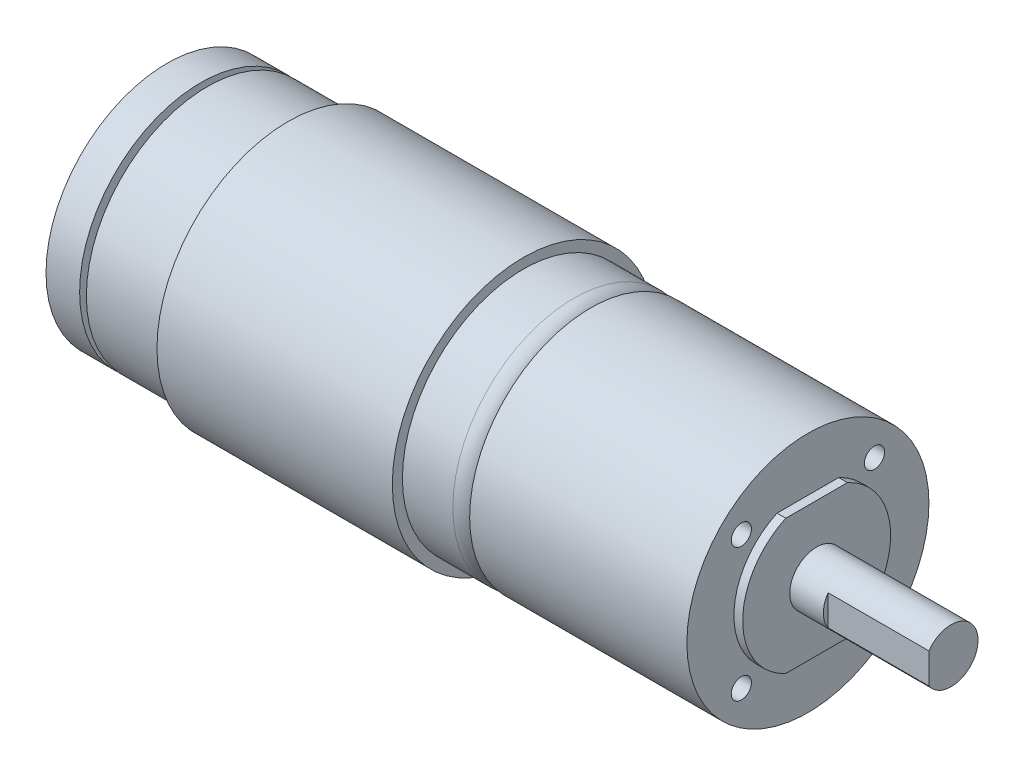
ISO-10303-21;
HEADER;
FILE_DESCRIPTION(('STEP AP214'),'2;1');
FILE_NAME('part.step','',(''),(''),'','','');
FILE_SCHEMA(('AUTOMOTIVE_DESIGN { 1 0 10303 214 1 1 1 1 }'));
ENDSEC;
DATA;
#1=APPLICATION_CONTEXT('core data for automotive mechanical design processes');
#2=APPLICATION_PROTOCOL_DEFINITION('international standard','automotive_design',2000,#1);
#3=PRODUCT_CONTEXT('',#1,'mechanical');
#4=PRODUCT('Part','Part','',(#3));
#5=PRODUCT_RELATED_PRODUCT_CATEGORY('part','',(#4));
#6=PRODUCT_DEFINITION_FORMATION('','',#4);
#7=PRODUCT_DEFINITION_CONTEXT('part definition',#1,'design');
#8=PRODUCT_DEFINITION('design','',#6,#7);
#9=PRODUCT_DEFINITION_SHAPE('','',#8);
#10=(LENGTH_UNIT() NAMED_UNIT(*) SI_UNIT(.MILLI.,.METRE.));
#11=(NAMED_UNIT(*) PLANE_ANGLE_UNIT() SI_UNIT($,.RADIAN.));
#12=(NAMED_UNIT(*) SI_UNIT($,.STERADIAN.) SOLID_ANGLE_UNIT());
#13=UNCERTAINTY_MEASURE_WITH_UNIT(LENGTH_MEASURE(1.E-05),#10,'distance_accuracy_value','');
#14=(GEOMETRIC_REPRESENTATION_CONTEXT(3) GLOBAL_UNCERTAINTY_ASSIGNED_CONTEXT((#13)) GLOBAL_UNIT_ASSIGNED_CONTEXT((#10,
#11,#12)) REPRESENTATION_CONTEXT('',''));
#15=CARTESIAN_POINT('',(0.,0.,0.));
#16=DIRECTION('',(0.,0.,1.));
#17=DIRECTION('',(1.,0.,0.));
#18=AXIS2_PLACEMENT_3D('',#15,#16,#17);
#19=CARTESIAN_POINT('',(-45.65,0.,0.));
#20=DIRECTION('',(-1.,0.,0.));
#21=DIRECTION('',(0.,0.,1.));
#22=AXIS2_PLACEMENT_3D('',#19,#20,#21);
#23=PLANE('',#22);
#24=CARTESIAN_POINT('',(-45.65,0.,0.));
#25=DIRECTION('',(-1.,0.,0.));
#26=DIRECTION('',(0.,-1.,0.));
#27=AXIS2_PLACEMENT_3D('',#24,#25,#26);
#28=CIRCLE('',#27,5.5);
#29=CARTESIAN_POINT('',(-45.65,5.5,0.));
#30=VERTEX_POINT('',#29);
#31=CARTESIAN_POINT('',(-45.65,0.,-5.5));
#32=VERTEX_POINT('',#31);
#33=EDGE_CURVE('P0_E60',#30,#32,#28,.T.);
#34=ORIENTED_EDGE('',*,*,#33,.T.);
#35=CARTESIAN_POINT('',(-45.65,0.,0.));
#36=DIRECTION('',(-1.,0.,0.));
#37=DIRECTION('',(0.,-1.,0.));
#38=AXIS2_PLACEMENT_3D('',#35,#36,#37);
#39=CIRCLE('',#38,5.5);
#40=EDGE_CURVE('P0_E63',#32,#30,#39,.T.);
#41=ORIENTED_EDGE('',*,*,#40,.T.);
#42=EDGE_LOOP('',(#34,#41));
#43=FACE_BOUND('',#42,.T.);
#44=CARTESIAN_POINT('',(-45.65,0.,0.));
#45=DIRECTION('',(-1.,0.,0.));
#46=DIRECTION('',(0.,0.,1.));
#47=AXIS2_PLACEMENT_3D('',#44,#45,#46);
#48=CIRCLE('',#47,18.);
#49=CARTESIAN_POINT('',(-45.65,0.,-18.));
#50=VERTEX_POINT('',#49);
#51=EDGE_CURVE('P0_E11',#50,#50,#48,.T.);
#52=ORIENTED_EDGE('',*,*,#51,.F.);
#53=EDGE_LOOP('',(#52));
#54=FACE_BOUND('',#53,.T.);
#55=ADVANCED_FACE('P0_F16',(#43,#54),#23,.F.);
#56=CARTESIAN_POINT('',(-50.65,0.,0.));
#57=DIRECTION('',(-1.,0.,0.));
#58=DIRECTION('',(0.,0.,1.));
#59=AXIS2_PLACEMENT_3D('',#56,#57,#58);
#60=PLANE('',#59);
#61=CARTESIAN_POINT('',(-50.65,0.,0.));
#62=DIRECTION('',(1.,0.,0.));
#63=DIRECTION('',(0.,-1.,0.));
#64=AXIS2_PLACEMENT_3D('',#61,#62,#63);
#65=CIRCLE('',#64,5.5);
#66=CARTESIAN_POINT('',(-50.65,5.5,0.));
#67=VERTEX_POINT('',#66);
#68=EDGE_CURVE('P0_E58',#67,#67,#65,.T.);
#69=ORIENTED_EDGE('',*,*,#68,.T.);
#70=EDGE_LOOP('',(#69));
#71=FACE_BOUND('',#70,.T.);
#72=CARTESIAN_POINT('',(-50.65,0.,0.));
#73=DIRECTION('',(-1.,0.,0.));
#74=DIRECTION('',(0.,0.,1.));
#75=AXIS2_PLACEMENT_3D('',#72,#73,#74);
#76=CIRCLE('',#75,18.);
#77=CARTESIAN_POINT('',(-50.65,0.,-18.));
#78=VERTEX_POINT('',#77);
#79=EDGE_CURVE('P0_E74',#78,#78,#76,.T.);
#80=ORIENTED_EDGE('',*,*,#79,.T.);
#81=EDGE_LOOP('',(#80));
#82=FACE_BOUND('',#81,.T.);
#83=ADVANCED_FACE('P0_F66',(#71,#82),#60,.T.);
#84=CARTESIAN_POINT('',(-45.65,0.,0.));
#85=DIRECTION('',(-1.,0.,0.));
#86=DIRECTION('',(0.,0.,1.));
#87=AXIS2_PLACEMENT_3D('',#84,#85,#86);
#88=CYLINDRICAL_SURFACE('',#87,18.);
#89=ORIENTED_EDGE('',*,*,#79,.F.);
#90=DIRECTION('',(1.,0.,0.));
#91=VECTOR('',#90,1.);
#92=CARTESIAN_POINT('',(-45.65,0.,-18.));
#93=LINE('',#92,#91);
#94=EDGE_CURVE('P0_E24',#78,#50,#93,.T.);
#95=ORIENTED_EDGE('',*,*,#94,.T.);
#96=ORIENTED_EDGE('',*,*,#51,.T.);
#97=ORIENTED_EDGE('',*,*,#94,.F.);
#98=EDGE_LOOP('',(#89,#95,#96,#97));
#99=FACE_BOUND('',#98,.T.);
#100=ADVANCED_FACE('P0_F80',(#99),#88,.T.);
#101=CARTESIAN_POINT('',(-45.65,0.,0.));
#102=DIRECTION('',(-1.,0.,0.));
#103=DIRECTION('',(0.,-1.,0.));
#104=AXIS2_PLACEMENT_3D('',#101,#102,#103);
#105=CYLINDRICAL_SURFACE('',#104,5.5);
#106=ORIENTED_EDGE('',*,*,#68,.F.);
#107=DIRECTION('',(1.,0.,0.));
#108=VECTOR('',#107,1.);
#109=CARTESIAN_POINT('',(-45.65,5.5,0.));
#110=LINE('',#109,#108);
#111=EDGE_CURVE('P0_E55',#67,#30,#110,.T.);
#112=ORIENTED_EDGE('',*,*,#111,.T.);
#113=ORIENTED_EDGE('',*,*,#40,.F.);
#114=ORIENTED_EDGE('',*,*,#33,.F.);
#115=ORIENTED_EDGE('',*,*,#111,.F.);
#116=EDGE_LOOP('',(#106,#112,#113,#114,#115));
#117=FACE_BOUND('',#116,.T.);
#118=ADVANCED_FACE('P0_F57',(#117),#105,.F.);
#119=CLOSED_SHELL('',(#55,#83,#100,#118));
#120=MANIFOLD_SOLID_BREP('P0_B1',#119);
#121=CARTESIAN_POINT('',(-44.65,0.,0.));
#122=DIRECTION('',(-1.,0.,0.));
#123=DIRECTION('',(0.,-1.,0.));
#124=AXIS2_PLACEMENT_3D('',#121,#122,#123);
#125=CYLINDRICAL_SURFACE('',#124,1.585);
#126=CARTESIAN_POINT('',(-57.65,0.,0.));
#127=DIRECTION('',(-1.,0.,0.));
#128=DIRECTION('',(0.,-1.,0.));
#129=AXIS2_PLACEMENT_3D('',#126,#127,#128);
#130=CIRCLE('',#129,1.585);
#131=CARTESIAN_POINT('',(-57.65,1.585,0.));
#132=VERTEX_POINT('',#131);
#133=EDGE_CURVE('P1_E24',#132,#132,#130,.T.);
#134=ORIENTED_EDGE('',*,*,#133,.F.);
#135=DIRECTION('',(1.,0.,0.));
#136=VECTOR('',#135,1.);
#137=CARTESIAN_POINT('',(-44.65,1.585,0.));
#138=LINE('',#137,#136);
#139=CARTESIAN_POINT('',(-48.65,1.585,0.));
#140=VERTEX_POINT('',#139);
#141=EDGE_CURVE('P1_E11',#132,#140,#138,.T.);
#142=ORIENTED_EDGE('',*,*,#141,.T.);
#143=CARTESIAN_POINT('',(-48.65,0.,0.));
#144=DIRECTION('',(1.,0.,0.));
#145=DIRECTION('',(0.,-1.,0.));
#146=AXIS2_PLACEMENT_3D('',#143,#144,#145);
#147=CIRCLE('',#146,1.585);
#148=EDGE_CURVE('P1_E202',#140,#140,#147,.T.);
#149=ORIENTED_EDGE('',*,*,#148,.F.);
#150=ORIENTED_EDGE('',*,*,#141,.F.);
#151=EDGE_LOOP('',(#134,#142,#149,#150));
#152=FACE_BOUND('',#151,.T.);
#153=ADVANCED_FACE('P1_F16',(#152),#125,.T.);
#154=CARTESIAN_POINT('',(-57.65,0.,0.));
#155=DIRECTION('',(-1.,0.,0.));
#156=DIRECTION('',(0.,0.,1.));
#157=AXIS2_PLACEMENT_3D('',#154,#155,#156);
#158=PLANE('',#157);
#159=ORIENTED_EDGE('',*,*,#133,.T.);
#160=EDGE_LOOP('',(#159));
#161=FACE_BOUND('',#160,.T.);
#162=ADVANCED_FACE('P1_F554',(#161),#158,.T.);
#163=CARTESIAN_POINT('',(-48.15,0.,0.));
#164=DIRECTION('',(1.,0.,0.));
#165=DIRECTION('',(0.,-1.,0.));
#166=AXIS2_PLACEMENT_3D('',#163,#164,#165);
#167=CONICAL_SURFACE('',#166,3.5,0.78539816339745);
#168=CARTESIAN_POINT('',(-48.65,0.,0.));
#169=DIRECTION('',(1.,0.,0.));
#170=DIRECTION('',(0.,-1.,0.));
#171=AXIS2_PLACEMENT_3D('',#168,#169,#170);
#172=CIRCLE('',#171,3.);
#173=CARTESIAN_POINT('',(-48.65,3.,0.));
#174=VERTEX_POINT('',#173);
#175=EDGE_CURVE('P1_E174',#174,#174,#172,.T.);
#176=ORIENTED_EDGE('',*,*,#175,.T.);
#177=DIRECTION('',(0.707106781186546,0.707106781186549,0.));
#178=VECTOR('',#177,1.);
#179=CARTESIAN_POINT('',(-48.15,3.5,0.));
#180=LINE('',#179,#178);
#181=CARTESIAN_POINT('',(-47.65,4.,0.));
#182=VERTEX_POINT('',#181);
#183=EDGE_CURVE('P1_E47',#174,#182,#180,.T.);
#184=ORIENTED_EDGE('',*,*,#183,.T.);
#185=CARTESIAN_POINT('',(-47.65,0.,0.));
#186=DIRECTION('',(-1.,0.,0.));
#187=DIRECTION('',(0.,-1.,0.));
#188=AXIS2_PLACEMENT_3D('',#185,#186,#187);
#189=CIRCLE('',#188,4.);
#190=EDGE_CURVE('P1_E176',#182,#182,#189,.T.);
#191=ORIENTED_EDGE('',*,*,#190,.T.);
#192=ORIENTED_EDGE('',*,*,#183,.F.);
#193=EDGE_LOOP('',(#176,#184,#191,#192));
#194=FACE_BOUND('',#193,.T.);
#195=ADVANCED_FACE('P1_F172',(#194),#167,.T.);
#196=CARTESIAN_POINT('',(-44.65,0.,0.));
#197=DIRECTION('',(-1.,0.,0.));
#198=DIRECTION('',(0.,-1.,0.));
#199=AXIS2_PLACEMENT_3D('',#196,#197,#198);
#200=CYLINDRICAL_SURFACE('',#199,4.);
#201=ORIENTED_EDGE('',*,*,#190,.F.);
#202=DIRECTION('',(1.,0.,0.));
#203=VECTOR('',#202,1.);
#204=CARTESIAN_POINT('',(-44.65,4.,0.));
#205=LINE('',#204,#203);
#206=CARTESIAN_POINT('',(-46.65,4.,0.));
#207=VERTEX_POINT('',#206);
#208=EDGE_CURVE('P1_E178',#182,#207,#205,.T.);
#209=ORIENTED_EDGE('',*,*,#208,.T.);
#210=CARTESIAN_POINT('',(-46.65,0.,0.));
#211=DIRECTION('',(1.,0.,0.));
#212=DIRECTION('',(0.,-1.,0.));
#213=AXIS2_PLACEMENT_3D('',#210,#211,#212);
#214=CIRCLE('',#213,4.);
#215=EDGE_CURVE('P1_E249',#207,#207,#214,.T.);
#216=ORIENTED_EDGE('',*,*,#215,.F.);
#217=ORIENTED_EDGE('',*,*,#208,.F.);
#218=EDGE_LOOP('',(#201,#209,#216,#217));
#219=FACE_BOUND('',#218,.T.);
#220=ADVANCED_FACE('P1_F537',(#219),#200,.T.);
#221=CARTESIAN_POINT('',(-48.65,0.,0.));
#222=DIRECTION('',(-1.,0.,0.));
#223=DIRECTION('',(0.,0.,1.));
#224=AXIS2_PLACEMENT_3D('',#221,#222,#223);
#225=PLANE('',#224);
#226=ORIENTED_EDGE('',*,*,#148,.T.);
#227=EDGE_LOOP('',(#226));
#228=FACE_BOUND('',#227,.T.);
#229=ORIENTED_EDGE('',*,*,#175,.F.);
#230=EDGE_LOOP('',(#229));
#231=FACE_BOUND('',#230,.T.);
#232=ADVANCED_FACE('P1_F528',(#228,#231),#225,.T.);
#233=CARTESIAN_POINT('',(-46.65,0.,0.));
#234=DIRECTION('',(-1.,0.,0.));
#235=DIRECTION('',(0.,0.,1.));
#236=AXIS2_PLACEMENT_3D('',#233,#234,#235);
#237=PLANE('',#236);
#238=ORIENTED_EDGE('',*,*,#215,.T.);
#239=EDGE_LOOP('',(#238));
#240=FACE_BOUND('',#239,.T.);
#241=CARTESIAN_POINT('',(-46.65,0.,0.));
#242=DIRECTION('',(1.,0.,0.));
#243=DIRECTION('',(0.,-1.,0.));
#244=AXIS2_PLACEMENT_3D('',#241,#242,#243);
#245=CIRCLE('',#244,4.5);
#246=CARTESIAN_POINT('',(-46.65,0.,-4.5));
#247=VERTEX_POINT('',#246);
#248=EDGE_CURVE('P1_E244',#247,#247,#245,.T.);
#249=ORIENTED_EDGE('',*,*,#248,.F.);
#250=EDGE_LOOP('',(#249));
#251=FACE_BOUND('',#250,.T.);
#252=ADVANCED_FACE('P1_F519',(#240,#251),#237,.T.);
#253=CARTESIAN_POINT('',(-45.65,0.,0.));
#254=DIRECTION('',(-1.,0.,0.));
#255=DIRECTION('',(0.,0.,1.));
#256=AXIS2_PLACEMENT_3D('',#253,#254,#255);
#257=TOROIDAL_SURFACE('',#256,4.5,1.);
#258=ORIENTED_EDGE('',*,*,#248,.T.);
#259=CARTESIAN_POINT('',(-45.65,0.,-4.5));
#260=DIRECTION('',(0.,-1.,0.));
#261=DIRECTION('',(0.,0.,-1.));
#262=AXIS2_PLACEMENT_3D('',#259,#260,#261);
#263=CIRCLE('',#262,1.);
#264=CARTESIAN_POINT('',(-45.65,0.,-5.5));
#265=VERTEX_POINT('',#264);
#266=EDGE_CURVE('P1_E248',#247,#265,#263,.T.);
#267=ORIENTED_EDGE('',*,*,#266,.T.);
#268=CARTESIAN_POINT('',(-45.65,0.,0.));
#269=DIRECTION('',(-1.,0.,0.));
#270=DIRECTION('',(0.,-1.,0.));
#271=AXIS2_PLACEMENT_3D('',#268,#269,#270);
#272=CIRCLE('',#271,5.5);
#273=CARTESIAN_POINT('',(-45.65,5.5,0.));
#274=VERTEX_POINT('',#273);
#275=EDGE_CURVE('P1_E240',#265,#274,#272,.T.);
#276=ORIENTED_EDGE('',*,*,#275,.T.);
#277=CARTESIAN_POINT('',(-45.65,0.,0.));
#278=DIRECTION('',(-1.,0.,0.));
#279=DIRECTION('',(0.,-1.,0.));
#280=AXIS2_PLACEMENT_3D('',#277,#278,#279);
#281=CIRCLE('',#280,5.5);
#282=EDGE_CURVE('P1_E234',#274,#265,#281,.T.);
#283=ORIENTED_EDGE('',*,*,#282,.T.);
#284=ORIENTED_EDGE('',*,*,#266,.F.);
#285=EDGE_LOOP('',(#258,#267,#276,#283,#284));
#286=FACE_BOUND('',#285,.T.);
#287=ADVANCED_FACE('P1_F510',(#286),#257,.T.);
#288=CARTESIAN_POINT('',(-44.65,0.,0.));
#289=DIRECTION('',(-1.,0.,0.));
#290=DIRECTION('',(0.,-1.,0.));
#291=AXIS2_PLACEMENT_3D('',#288,#289,#290);
#292=CYLINDRICAL_SURFACE('',#291,5.5);
#293=ORIENTED_EDGE('',*,*,#282,.F.);
#294=DIRECTION('',(1.,0.,0.));
#295=VECTOR('',#294,1.);
#296=CARTESIAN_POINT('',(-44.65,5.5,0.));
#297=LINE('',#296,#295);
#298=CARTESIAN_POINT('',(-44.65,5.5,0.));
#299=VERTEX_POINT('',#298);
#300=EDGE_CURVE('P1_E238',#274,#299,#297,.T.);
#301=ORIENTED_EDGE('',*,*,#300,.T.);
#302=CARTESIAN_POINT('',(-44.65,0.,0.));
#303=DIRECTION('',(1.,0.,0.));
#304=DIRECTION('',(0.,-1.,0.));
#305=AXIS2_PLACEMENT_3D('',#302,#303,#304);
#306=CIRCLE('',#305,5.5);
#307=EDGE_CURVE('P1_E643',#299,#299,#306,.T.);
#308=ORIENTED_EDGE('',*,*,#307,.F.);
#309=ORIENTED_EDGE('',*,*,#300,.F.);
#310=ORIENTED_EDGE('',*,*,#275,.F.);
#311=EDGE_LOOP('',(#293,#301,#308,#309,#310));
#312=FACE_BOUND('',#311,.T.);
#313=ADVANCED_FACE('P1_F501',(#312),#292,.T.);
#314=CARTESIAN_POINT('',(44.65,-9.89949493661167,9.89949493661167));
#315=DIRECTION('',(-1.,0.,0.));
#316=DIRECTION('',(0.,1.,0.));
#317=AXIS2_PLACEMENT_3D('',#314,#315,#316);
#318=CYLINDRICAL_SURFACE('',#317,1.5);
#319=CARTESIAN_POINT('',(44.65,-9.89949493661167,9.89949493661167));
#320=DIRECTION('',(-1.,0.,0.));
#321=DIRECTION('',(0.,1.,0.));
#322=AXIS2_PLACEMENT_3D('',#319,#320,#321);
#323=CIRCLE('',#322,1.5);
#324=CARTESIAN_POINT('',(44.65,-11.3994949366117,9.89949493661167));
#325=VERTEX_POINT('',#324);
#326=EDGE_CURVE('P1_E603',#325,#325,#323,.T.);
#327=ORIENTED_EDGE('',*,*,#326,.F.);
#328=DIRECTION('',(-1.,0.,0.));
#329=VECTOR('',#328,1.);
#330=CARTESIAN_POINT('',(44.65,-11.3994949366117,9.89949493661167));
#331=LINE('',#330,#329);
#332=CARTESIAN_POINT('',(36.95,-11.3994949366117,9.89949493661167));
#333=VERTEX_POINT('',#332);
#334=EDGE_CURVE('P1_E231',#325,#333,#331,.T.);
#335=ORIENTED_EDGE('',*,*,#334,.T.);
#336=CARTESIAN_POINT('',(36.95,-9.89949493661167,9.89949493661167));
#337=DIRECTION('',(-1.,0.,0.));
#338=DIRECTION('',(0.,1.,0.));
#339=AXIS2_PLACEMENT_3D('',#336,#337,#338);
#340=CIRCLE('',#339,1.5);
#341=EDGE_CURVE('P1_E227',#333,#333,#340,.T.);
#342=ORIENTED_EDGE('',*,*,#341,.T.);
#343=ORIENTED_EDGE('',*,*,#334,.F.);
#344=EDGE_LOOP('',(#327,#335,#342,#343));
#345=FACE_BOUND('',#344,.T.);
#346=ADVANCED_FACE('P1_F492',(#345),#318,.F.);
#347=CARTESIAN_POINT('',(36.95,-9.89949493661167,9.89949493661167));
#348=DIRECTION('',(1.,0.,0.));
#349=DIRECTION('',(0.,1.,0.));
#350=AXIS2_PLACEMENT_3D('',#347,#348,#349);
#351=PLANE('',#350);
#352=ORIENTED_EDGE('',*,*,#341,.F.);
#353=EDGE_LOOP('',(#352));
#354=FACE_BOUND('',#353,.T.);
#355=ADVANCED_FACE('P1_F483',(#354),#351,.T.);
#356=CARTESIAN_POINT('',(44.65,-9.89949493661167,-9.89949493661167));
#357=DIRECTION('',(-1.,0.,0.));
#358=DIRECTION('',(0.,1.,0.));
#359=AXIS2_PLACEMENT_3D('',#356,#357,#358);
#360=CYLINDRICAL_SURFACE('',#359,1.5);
#361=CARTESIAN_POINT('',(44.65,-9.89949493661167,-9.89949493661167));
#362=DIRECTION('',(-1.,0.,0.));
#363=DIRECTION('',(0.,1.,0.));
#364=AXIS2_PLACEMENT_3D('',#361,#362,#363);
#365=CIRCLE('',#364,1.5);
#366=CARTESIAN_POINT('',(44.65,-11.3994949366117,-9.89949493661167));
#367=VERTEX_POINT('',#366);
#368=EDGE_CURVE('P1_E608',#367,#367,#365,.T.);
#369=ORIENTED_EDGE('',*,*,#368,.F.);
#370=DIRECTION('',(-1.,0.,0.));
#371=VECTOR('',#370,1.);
#372=CARTESIAN_POINT('',(44.65,-11.3994949366117,-9.89949493661167));
#373=LINE('',#372,#371);
#374=CARTESIAN_POINT('',(36.95,-11.3994949366117,-9.89949493661167));
#375=VERTEX_POINT('',#374);
#376=EDGE_CURVE('P1_E224',#367,#375,#373,.T.);
#377=ORIENTED_EDGE('',*,*,#376,.T.);
#378=CARTESIAN_POINT('',(36.95,-9.89949493661167,-9.89949493661167));
#379=DIRECTION('',(-1.,0.,0.));
#380=DIRECTION('',(0.,1.,0.));
#381=AXIS2_PLACEMENT_3D('',#378,#379,#380);
#382=CIRCLE('',#381,1.5);
#383=EDGE_CURVE('P1_E220',#375,#375,#382,.T.);
#384=ORIENTED_EDGE('',*,*,#383,.T.);
#385=ORIENTED_EDGE('',*,*,#376,.F.);
#386=EDGE_LOOP('',(#369,#377,#384,#385));
#387=FACE_BOUND('',#386,.T.);
#388=ADVANCED_FACE('P1_F474',(#387),#360,.F.);
#389=CARTESIAN_POINT('',(36.95,-9.89949493661167,-9.89949493661167));
#390=DIRECTION('',(1.,0.,0.));
#391=DIRECTION('',(0.,1.,0.));
#392=AXIS2_PLACEMENT_3D('',#389,#390,#391);
#393=PLANE('',#392);
#394=ORIENTED_EDGE('',*,*,#383,.F.);
#395=EDGE_LOOP('',(#394));
#396=FACE_BOUND('',#395,.T.);
#397=ADVANCED_FACE('P1_F432',(#396),#393,.T.);
#398=CARTESIAN_POINT('',(44.65,9.89949493661167,9.89949493661167));
#399=DIRECTION('',(-1.,0.,0.));
#400=DIRECTION('',(0.,1.,0.));
#401=AXIS2_PLACEMENT_3D('',#398,#399,#400);
#402=CYLINDRICAL_SURFACE('',#401,1.5);
#403=CARTESIAN_POINT('',(44.65,9.89949493661167,9.89949493661167));
#404=DIRECTION('',(-1.,0.,0.));
#405=DIRECTION('',(0.,1.,0.));
#406=AXIS2_PLACEMENT_3D('',#403,#404,#405);
#407=CIRCLE('',#406,1.5);
#408=CARTESIAN_POINT('',(44.65,8.39949493661167,9.89949493661167));
#409=VERTEX_POINT('',#408);
#410=EDGE_CURVE('P1_E615',#409,#409,#407,.T.);
#411=ORIENTED_EDGE('',*,*,#410,.F.);
#412=DIRECTION('',(-1.,0.,0.));
#413=VECTOR('',#412,1.);
#414=CARTESIAN_POINT('',(44.65,8.39949493661167,9.89949493661167));
#415=LINE('',#414,#413);
#416=CARTESIAN_POINT('',(36.95,8.39949493661167,9.89949493661167));
#417=VERTEX_POINT('',#416);
#418=EDGE_CURVE('P1_E219',#409,#417,#415,.T.);
#419=ORIENTED_EDGE('',*,*,#418,.T.);
#420=CARTESIAN_POINT('',(36.95,9.89949493661167,9.89949493661167));
#421=DIRECTION('',(-1.,0.,0.));
#422=DIRECTION('',(0.,1.,0.));
#423=AXIS2_PLACEMENT_3D('',#420,#421,#422);
#424=CIRCLE('',#423,1.5);
#425=EDGE_CURVE('P1_E215',#417,#417,#424,.T.);
#426=ORIENTED_EDGE('',*,*,#425,.T.);
#427=ORIENTED_EDGE('',*,*,#418,.F.);
#428=EDGE_LOOP('',(#411,#419,#426,#427));
#429=FACE_BOUND('',#428,.T.);
#430=ADVANCED_FACE('P1_F426',(#429),#402,.F.);
#431=CARTESIAN_POINT('',(36.95,9.89949493661167,9.89949493661167));
#432=DIRECTION('',(1.,0.,0.));
#433=DIRECTION('',(0.,1.,0.));
#434=AXIS2_PLACEMENT_3D('',#431,#432,#433);
#435=PLANE('',#434);
#436=ORIENTED_EDGE('',*,*,#425,.F.);
#437=EDGE_LOOP('',(#436));
#438=FACE_BOUND('',#437,.T.);
#439=ADVANCED_FACE('P1_F431',(#438),#435,.T.);
#440=CARTESIAN_POINT('',(44.65,9.89949493661167,-9.89949493661167));
#441=DIRECTION('',(-1.,0.,0.));
#442=DIRECTION('',(0.,1.,0.));
#443=AXIS2_PLACEMENT_3D('',#440,#441,#442);
#444=CYLINDRICAL_SURFACE('',#443,1.5);
#445=CARTESIAN_POINT('',(44.65,9.89949493661167,-9.89949493661167));
#446=DIRECTION('',(-1.,0.,0.));
#447=DIRECTION('',(0.,1.,0.));
#448=AXIS2_PLACEMENT_3D('',#445,#446,#447);
#449=CIRCLE('',#448,1.5);
#450=CARTESIAN_POINT('',(44.65,8.39949493661166,-9.89949493661167));
#451=VERTEX_POINT('',#450);
#452=EDGE_CURVE('P1_E624',#451,#451,#449,.T.);
#453=ORIENTED_EDGE('',*,*,#452,.F.);
#454=DIRECTION('',(-1.,0.,0.));
#455=VECTOR('',#454,1.);
#456=CARTESIAN_POINT('',(44.65,8.39949493661166,-9.89949493661167));
#457=LINE('',#456,#455);
#458=CARTESIAN_POINT('',(36.95,8.39949493661166,-9.89949493661167));
#459=VERTEX_POINT('',#458);
#460=EDGE_CURVE('P1_E212',#451,#459,#457,.T.);
#461=ORIENTED_EDGE('',*,*,#460,.T.);
#462=CARTESIAN_POINT('',(36.95,9.89949493661167,-9.89949493661167));
#463=DIRECTION('',(-1.,0.,0.));
#464=DIRECTION('',(0.,1.,0.));
#465=AXIS2_PLACEMENT_3D('',#462,#463,#464);
#466=CIRCLE('',#465,1.5);
#467=EDGE_CURVE('P1_E208',#459,#459,#466,.T.);
#468=ORIENTED_EDGE('',*,*,#467,.T.);
#469=ORIENTED_EDGE('',*,*,#460,.F.);
#470=EDGE_LOOP('',(#453,#461,#468,#469));
#471=FACE_BOUND('',#470,.T.);
#472=ADVANCED_FACE('P1_F451',(#471),#444,.F.);
#473=CARTESIAN_POINT('',(36.95,9.89949493661167,-9.89949493661167));
#474=DIRECTION('',(1.,0.,0.));
#475=DIRECTION('',(0.,1.,0.));
#476=AXIS2_PLACEMENT_3D('',#473,#474,#475);
#477=PLANE('',#476);
#478=ORIENTED_EDGE('',*,*,#467,.F.);
#479=EDGE_LOOP('',(#478));
#480=FACE_BOUND('',#479,.T.);
#481=ADVANCED_FACE('P1_F442',(#480),#477,.T.);
#482=CARTESIAN_POINT('',(50.95,0.,4.));
#483=DIRECTION('',(-1.,0.,0.));
#484=DIRECTION('',(0.,0.,1.));
#485=AXIS2_PLACEMENT_3D('',#482,#483,#484);
#486=PLANE('',#485);
#487=CARTESIAN_POINT('',(50.95,0.,0.));
#488=DIRECTION('',(-1.,0.,0.));
#489=DIRECTION('',(0.,1.,0.));
#490=AXIS2_PLACEMENT_3D('',#487,#488,#489);
#491=CIRCLE('',#490,4.);
#492=CARTESIAN_POINT('',(50.95,-2.26053091109146,3.3));
#493=VERTEX_POINT('',#492);
#494=CARTESIAN_POINT('',(50.95,2.26053091109146,3.3));
#495=VERTEX_POINT('',#494);
#496=EDGE_CURVE('P1_E193',#493,#495,#491,.T.);
#497=ORIENTED_EDGE('',*,*,#496,.F.);
#498=DIRECTION('',(0.,-1.,0.));
#499=VECTOR('',#498,1.);
#500=CARTESIAN_POINT('',(50.95,0.,3.3));
#501=LINE('',#500,#499);
#502=EDGE_CURVE('P1_E201',#495,#493,#501,.T.);
#503=ORIENTED_EDGE('',*,*,#502,.F.);
#504=EDGE_LOOP('',(#497,#503));
#505=FACE_BOUND('',#504,.T.);
#506=ADVANCED_FACE('P1_F364',(#505),#486,.F.);
#507=CARTESIAN_POINT('',(50.95,0.,3.3));
#508=DIRECTION('',(0.,0.,-1.));
#509=DIRECTION('',(0.,-1.,0.));
#510=AXIS2_PLACEMENT_3D('',#507,#508,#509);
#511=PLANE('',#510);
#512=DIRECTION('',(-1.,0.,0.));
#513=VECTOR('',#512,1.);
#514=CARTESIAN_POINT('',(44.65,-2.26053091109146,3.3));
#515=LINE('',#514,#513);
#516=CARTESIAN_POINT('',(65.95,-2.26053091109146,3.3));
#517=VERTEX_POINT('',#516);
#518=EDGE_CURVE('P1_E190',#517,#493,#515,.T.);
#519=ORIENTED_EDGE('',*,*,#518,.F.);
#520=DIRECTION('',(0.,-1.,0.));
#521=VECTOR('',#520,1.);
#522=CARTESIAN_POINT('',(65.95,0.,3.3));
#523=LINE('',#522,#521);
#524=CARTESIAN_POINT('',(65.95,2.26053091109146,3.3));
#525=VERTEX_POINT('',#524);
#526=EDGE_CURVE('P1_E678',#525,#517,#523,.T.);
#527=ORIENTED_EDGE('',*,*,#526,.F.);
#528=DIRECTION('',(1.,0.,0.));
#529=VECTOR('',#528,1.);
#530=CARTESIAN_POINT('',(44.65,2.26053091109146,3.3));
#531=LINE('',#530,#529);
#532=EDGE_CURVE('P1_E197',#495,#525,#531,.T.);
#533=ORIENTED_EDGE('',*,*,#532,.F.);
#534=ORIENTED_EDGE('',*,*,#502,.T.);
#535=EDGE_LOOP('',(#519,#527,#533,#534));
#536=FACE_BOUND('',#535,.T.);
#537=ADVANCED_FACE('P1_F358',(#536),#511,.F.);
#538=CARTESIAN_POINT('',(44.65,0.,0.));
#539=DIRECTION('',(1.,0.,0.));
#540=DIRECTION('',(0.,1.,0.));
#541=AXIS2_PLACEMENT_3D('',#538,#539,#540);
#542=CYLINDRICAL_SURFACE('',#541,4.);
#543=ORIENTED_EDGE('',*,*,#518,.T.);
#544=ORIENTED_EDGE('',*,*,#496,.T.);
#545=ORIENTED_EDGE('',*,*,#532,.T.);
#546=CARTESIAN_POINT('',(65.95,0.,0.));
#547=DIRECTION('',(1.,0.,0.));
#548=DIRECTION('',(0.,1.,0.));
#549=AXIS2_PLACEMENT_3D('',#546,#547,#548);
#550=CIRCLE('',#549,4.);
#551=CARTESIAN_POINT('',(65.95,-4.,0.));
#552=VERTEX_POINT('',#551);
#553=EDGE_CURVE('P1_E188',#552,#525,#550,.T.);
#554=ORIENTED_EDGE('',*,*,#553,.F.);
#555=DIRECTION('',(-1.,0.,0.));
#556=VECTOR('',#555,1.);
#557=CARTESIAN_POINT('',(44.65,-4.,0.));
#558=LINE('',#557,#556);
#559=CARTESIAN_POINT('',(45.95,-4.,0.));
#560=VERTEX_POINT('',#559);
#561=EDGE_CURVE('P1_E198',#552,#560,#558,.T.);
#562=ORIENTED_EDGE('',*,*,#561,.T.);
#563=CARTESIAN_POINT('',(45.95,0.,0.));
#564=DIRECTION('',(-1.,0.,0.));
#565=DIRECTION('',(0.,1.,0.));
#566=AXIS2_PLACEMENT_3D('',#563,#564,#565);
#567=CIRCLE('',#566,4.);
#568=EDGE_CURVE('P1_E662',#560,#560,#567,.T.);
#569=ORIENTED_EDGE('',*,*,#568,.F.);
#570=ORIENTED_EDGE('',*,*,#561,.F.);
#571=CARTESIAN_POINT('',(65.95,0.,0.));
#572=DIRECTION('',(1.,0.,0.));
#573=DIRECTION('',(0.,1.,0.));
#574=AXIS2_PLACEMENT_3D('',#571,#572,#573);
#575=CIRCLE('',#574,4.);
#576=EDGE_CURVE('P1_E682',#517,#552,#575,.T.);
#577=ORIENTED_EDGE('',*,*,#576,.F.);
#578=EDGE_LOOP('',(#543,#544,#545,#554,#562,#569,#570,#577));
#579=FACE_BOUND('',#578,.T.);
#580=ADVANCED_FACE('P1_F363',(#579),#542,.T.);
#581=CARTESIAN_POINT('',(65.95,0.,0.));
#582=DIRECTION('',(1.,0.,0.));
#583=DIRECTION('',(0.,1.,0.));
#584=AXIS2_PLACEMENT_3D('',#581,#582,#583);
#585=PLANE('',#584);
#586=ORIENTED_EDGE('',*,*,#526,.T.);
#587=ORIENTED_EDGE('',*,*,#576,.T.);
#588=ORIENTED_EDGE('',*,*,#553,.T.);
#589=EDGE_LOOP('',(#586,#587,#588));
#590=FACE_BOUND('',#589,.T.);
#591=ADVANCED_FACE('P1_F394',(#590),#585,.T.);
#592=CARTESIAN_POINT('',(44.65,10.,-4.58257569495585));
#593=DIRECTION('',(0.,1.,0.));
#594=DIRECTION('',(1.,0.,0.));
#595=AXIS2_PLACEMENT_3D('',#592,#593,#594);
#596=PLANE('',#595);
#597=DIRECTION('',(0.,0.,-1.));
#598=VECTOR('',#597,1.);
#599=CARTESIAN_POINT('',(44.65,10.,6.70871215252208));
#600=LINE('',#599,#598);
#601=CARTESIAN_POINT('',(44.65,10.,4.58257569495585));
#602=VERTEX_POINT('',#601);
#603=CARTESIAN_POINT('',(44.65,10.,-4.58257569495585));
#604=VERTEX_POINT('',#603);
#605=EDGE_CURVE('P1_E628',#602,#604,#600,.T.);
#606=ORIENTED_EDGE('',*,*,#605,.F.);
#607=DIRECTION('',(1.,0.,0.));
#608=VECTOR('',#607,1.);
#609=CARTESIAN_POINT('',(44.65,10.,4.58257569495585));
#610=LINE('',#609,#608);
#611=CARTESIAN_POINT('',(45.95,10.,4.58257569495585));
#612=VERTEX_POINT('',#611);
#613=EDGE_CURVE('P1_E669',#602,#612,#610,.T.);
#614=ORIENTED_EDGE('',*,*,#613,.T.);
#615=DIRECTION('',(0.,0.,1.));
#616=VECTOR('',#615,1.);
#617=CARTESIAN_POINT('',(45.95,10.,0.));
#618=LINE('',#617,#616);
#619=CARTESIAN_POINT('',(45.95,10.,-4.58257569495585));
#620=VERTEX_POINT('',#619);
#621=EDGE_CURVE('P1_E656',#620,#612,#618,.T.);
#622=ORIENTED_EDGE('',*,*,#621,.F.);
#623=DIRECTION('',(1.,0.,0.));
#624=VECTOR('',#623,1.);
#625=CARTESIAN_POINT('',(44.65,10.,-4.58257569495585));
#626=LINE('',#625,#624);
#627=EDGE_CURVE('P1_E675',#604,#620,#626,.T.);
#628=ORIENTED_EDGE('',*,*,#627,.F.);
#629=EDGE_LOOP('',(#606,#614,#622,#628));
#630=FACE_BOUND('',#629,.T.);
#631=ADVANCED_FACE('P1_F399',(#630),#596,.T.);
#632=CARTESIAN_POINT('',(44.65,0.,0.));
#633=DIRECTION('',(1.,0.,0.));
#634=DIRECTION('',(0.,1.,0.));
#635=AXIS2_PLACEMENT_3D('',#632,#633,#634);
#636=CYLINDRICAL_SURFACE('',#635,11.);
#637=CARTESIAN_POINT('',(44.65,0.,0.));
#638=DIRECTION('',(-1.,0.,0.));
#639=DIRECTION('',(0.,1.,0.));
#640=AXIS2_PLACEMENT_3D('',#637,#638,#639);
#641=CIRCLE('',#640,11.);
#642=CARTESIAN_POINT('',(44.65,-10.,-4.58257569495584));
#643=VERTEX_POINT('',#642);
#644=EDGE_CURVE('P1_E632',#604,#643,#641,.T.);
#645=ORIENTED_EDGE('',*,*,#644,.F.);
#646=ORIENTED_EDGE('',*,*,#627,.T.);
#647=CARTESIAN_POINT('',(45.95,0.,0.));
#648=DIRECTION('',(1.,0.,0.));
#649=DIRECTION('',(0.,1.,0.));
#650=AXIS2_PLACEMENT_3D('',#647,#648,#649);
#651=CIRCLE('',#650,11.);
#652=CARTESIAN_POINT('',(45.95,-10.,-4.58257569495584));
#653=VERTEX_POINT('',#652);
#654=EDGE_CURVE('P1_E652',#653,#620,#651,.T.);
#655=ORIENTED_EDGE('',*,*,#654,.F.);
#656=DIRECTION('',(1.,0.,0.));
#657=VECTOR('',#656,1.);
#658=CARTESIAN_POINT('',(44.65,-10.,-4.58257569495584));
#659=LINE('',#658,#657);
#660=EDGE_CURVE('P1_E672',#643,#653,#659,.T.);
#661=ORIENTED_EDGE('',*,*,#660,.F.);
#662=EDGE_LOOP('',(#645,#646,#655,#661));
#663=FACE_BOUND('',#662,.T.);
#664=ADVANCED_FACE('P1_F388',(#663),#636,.T.);
#665=CARTESIAN_POINT('',(44.65,-10.,4.58257569495584));
#666=DIRECTION('',(0.,-1.,0.));
#667=DIRECTION('',(0.,0.,-1.));
#668=AXIS2_PLACEMENT_3D('',#665,#666,#667);
#669=PLANE('',#668);
#670=DIRECTION('',(0.,0.,1.));
#671=VECTOR('',#670,1.);
#672=CARTESIAN_POINT('',(44.65,-10.,11.2912878474779));
#673=LINE('',#672,#671);
#674=CARTESIAN_POINT('',(44.65,-10.,4.58257569495584));
#675=VERTEX_POINT('',#674);
#676=EDGE_CURVE('P1_E638',#643,#675,#673,.T.);
#677=ORIENTED_EDGE('',*,*,#676,.F.);
#678=ORIENTED_EDGE('',*,*,#660,.T.);
#679=DIRECTION('',(0.,0.,-1.));
#680=VECTOR('',#679,1.);
#681=CARTESIAN_POINT('',(45.95,-10.,0.));
#682=LINE('',#681,#680);
#683=CARTESIAN_POINT('',(45.95,-10.,4.58257569495584));
#684=VERTEX_POINT('',#683);
#685=EDGE_CURVE('P1_E648',#684,#653,#682,.T.);
#686=ORIENTED_EDGE('',*,*,#685,.F.);
#687=DIRECTION('',(1.,0.,0.));
#688=VECTOR('',#687,1.);
#689=CARTESIAN_POINT('',(44.65,-10.,4.58257569495584));
#690=LINE('',#689,#688);
#691=EDGE_CURVE('P1_E666',#675,#684,#690,.T.);
#692=ORIENTED_EDGE('',*,*,#691,.F.);
#693=EDGE_LOOP('',(#677,#678,#686,#692));
#694=FACE_BOUND('',#693,.T.);
#695=ADVANCED_FACE('P1_F334',(#694),#669,.T.);
#696=CARTESIAN_POINT('',(44.65,0.,0.));
#697=DIRECTION('',(1.,0.,0.));
#698=DIRECTION('',(0.,1.,0.));
#699=AXIS2_PLACEMENT_3D('',#696,#697,#698);
#700=CYLINDRICAL_SURFACE('',#699,11.);
#701=CARTESIAN_POINT('',(44.65,0.,0.));
#702=DIRECTION('',(-1.,0.,0.));
#703=DIRECTION('',(0.,1.,0.));
#704=AXIS2_PLACEMENT_3D('',#701,#702,#703);
#705=CIRCLE('',#704,11.);
#706=EDGE_CURVE('P1_E639',#675,#602,#705,.T.);
#707=ORIENTED_EDGE('',*,*,#706,.F.);
#708=ORIENTED_EDGE('',*,*,#691,.T.);
#709=CARTESIAN_POINT('',(45.95,0.,0.));
#710=DIRECTION('',(1.,0.,0.));
#711=DIRECTION('',(0.,1.,0.));
#712=AXIS2_PLACEMENT_3D('',#709,#710,#711);
#713=CIRCLE('',#712,11.);
#714=EDGE_CURVE('P1_E644',#612,#684,#713,.T.);
#715=ORIENTED_EDGE('',*,*,#714,.F.);
#716=ORIENTED_EDGE('',*,*,#613,.F.);
#717=EDGE_LOOP('',(#707,#708,#715,#716));
#718=FACE_BOUND('',#717,.T.);
#719=ADVANCED_FACE('P1_F298',(#718),#700,.T.);
#720=CARTESIAN_POINT('',(45.95,0.,0.));
#721=DIRECTION('',(1.,0.,0.));
#722=DIRECTION('',(0.,1.,0.));
#723=AXIS2_PLACEMENT_3D('',#720,#721,#722);
#724=PLANE('',#723);
#725=ORIENTED_EDGE('',*,*,#568,.T.);
#726=EDGE_LOOP('',(#725));
#727=FACE_BOUND('',#726,.T.);
#728=ORIENTED_EDGE('',*,*,#714,.T.);
#729=ORIENTED_EDGE('',*,*,#685,.T.);
#730=ORIENTED_EDGE('',*,*,#654,.T.);
#731=ORIENTED_EDGE('',*,*,#621,.T.);
#732=EDGE_LOOP('',(#728,#729,#730,#731));
#733=FACE_BOUND('',#732,.T.);
#734=ADVANCED_FACE('P1_F279',(#727,#733),#724,.T.);
#735=CARTESIAN_POINT('',(-44.65,0.,0.));
#736=DIRECTION('',(-1.,0.,0.));
#737=DIRECTION('',(0.,0.,1.));
#738=AXIS2_PLACEMENT_3D('',#735,#736,#737);
#739=PLANE('',#738);
#740=ORIENTED_EDGE('',*,*,#307,.T.);
#741=EDGE_LOOP('',(#740));
#742=FACE_BOUND('',#741,.T.);
#743=CARTESIAN_POINT('',(-44.65,0.,0.));
#744=DIRECTION('',(-1.,0.,0.));
#745=DIRECTION('',(0.,0.,1.));
#746=AXIS2_PLACEMENT_3D('',#743,#744,#745);
#747=CIRCLE('',#746,18.);
#748=CARTESIAN_POINT('',(-44.65,0.,-18.));
#749=VERTEX_POINT('',#748);
#750=EDGE_CURVE('P1_E745',#749,#749,#747,.T.);
#751=ORIENTED_EDGE('',*,*,#750,.T.);
#752=EDGE_LOOP('',(#751));
#753=FACE_BOUND('',#752,.T.);
#754=ADVANCED_FACE('P1_F273',(#742,#753),#739,.T.);
#755=CARTESIAN_POINT('',(44.65,0.,18.));
#756=DIRECTION('',(1.,0.,0.));
#757=DIRECTION('',(0.,1.,0.));
#758=AXIS2_PLACEMENT_3D('',#755,#756,#757);
#759=PLANE('',#758);
#760=ORIENTED_EDGE('',*,*,#605,.T.);
#761=ORIENTED_EDGE('',*,*,#644,.T.);
#762=ORIENTED_EDGE('',*,*,#676,.T.);
#763=ORIENTED_EDGE('',*,*,#706,.T.);
#764=EDGE_LOOP('',(#760,#761,#762,#763));
#765=FACE_BOUND('',#764,.T.);
#766=ORIENTED_EDGE('',*,*,#452,.T.);
#767=EDGE_LOOP('',(#766));
#768=FACE_BOUND('',#767,.T.);
#769=ORIENTED_EDGE('',*,*,#410,.T.);
#770=EDGE_LOOP('',(#769));
#771=FACE_BOUND('',#770,.T.);
#772=ORIENTED_EDGE('',*,*,#368,.T.);
#773=EDGE_LOOP('',(#772));
#774=FACE_BOUND('',#773,.T.);
#775=ORIENTED_EDGE('',*,*,#326,.T.);
#776=EDGE_LOOP('',(#775));
#777=FACE_BOUND('',#776,.T.);
#778=CARTESIAN_POINT('',(44.65,0.,0.));
#779=DIRECTION('',(-1.,0.,0.));
#780=DIRECTION('',(0.,0.,1.));
#781=AXIS2_PLACEMENT_3D('',#778,#779,#780);
#782=CIRCLE('',#781,18.);
#783=CARTESIAN_POINT('',(44.65,0.,-18.));
#784=VERTEX_POINT('',#783);
#785=EDGE_CURVE('P1_E609',#784,#784,#782,.T.);
#786=ORIENTED_EDGE('',*,*,#785,.F.);
#787=EDGE_LOOP('',(#786));
#788=FACE_BOUND('',#787,.T.);
#789=ADVANCED_FACE('P1_F278',(#765,#768,#771,#774,#777,#788),#759,.T.);
#790=CARTESIAN_POINT('',(28.5,0.,0.));
#791=DIRECTION('',(-1.,0.,0.));
#792=DIRECTION('',(0.,0.,1.));
#793=AXIS2_PLACEMENT_3D('',#790,#791,#792);
#794=CYLINDRICAL_SURFACE('',#793,18.);
#795=CARTESIAN_POINT('',(12.35,0.,0.));
#796=DIRECTION('',(-1.,0.,0.));
#797=DIRECTION('',(0.,0.,1.));
#798=AXIS2_PLACEMENT_3D('',#795,#796,#797);
#799=CIRCLE('',#798,18.);
#800=CARTESIAN_POINT('',(12.35,0.,-18.));
#801=VERTEX_POINT('',#800);
#802=EDGE_CURVE('P1_E729',#801,#801,#799,.T.);
#803=ORIENTED_EDGE('',*,*,#802,.F.);
#804=DIRECTION('',(1.,0.,0.));
#805=VECTOR('',#804,1.);
#806=CARTESIAN_POINT('',(28.5,0.,-18.));
#807=LINE('',#806,#805);
#808=EDGE_CURVE('P1_E617',#801,#784,#807,.T.);
#809=ORIENTED_EDGE('',*,*,#808,.T.);
#810=ORIENTED_EDGE('',*,*,#785,.T.);
#811=ORIENTED_EDGE('',*,*,#808,.F.);
#812=EDGE_LOOP('',(#803,#809,#810,#811));
#813=FACE_BOUND('',#812,.T.);
#814=ADVANCED_FACE('P1_F345',(#813),#794,.T.);
#815=CARTESIAN_POINT('',(12.35,0.,15.5));
#816=DIRECTION('',(-1.,0.,0.));
#817=DIRECTION('',(0.,0.,1.));
#818=AXIS2_PLACEMENT_3D('',#815,#816,#817);
#819=PLANE('',#818);
#820=CARTESIAN_POINT('',(12.35,0.,0.));
#821=DIRECTION('',(-1.,0.,0.));
#822=DIRECTION('',(0.,0.,1.));
#823=AXIS2_PLACEMENT_3D('',#820,#821,#822);
#824=CIRCLE('',#823,15.5);
#825=CARTESIAN_POINT('',(12.35,0.,-15.5));
#826=VERTEX_POINT('',#825);
#827=EDGE_CURVE('P1_E732',#826,#826,#824,.T.);
#828=ORIENTED_EDGE('',*,*,#827,.F.);
#829=EDGE_LOOP('',(#828));
#830=FACE_BOUND('',#829,.T.);
#831=ORIENTED_EDGE('',*,*,#802,.T.);
#832=EDGE_LOOP('',(#831));
#833=FACE_BOUND('',#832,.T.);
#834=ADVANCED_FACE('P1_F340',(#830,#833),#819,.T.);
#835=CARTESIAN_POINT('',(9.85,0.,0.));
#836=DIRECTION('',(-1.,0.,0.));
#837=DIRECTION('',(0.,0.,1.));
#838=AXIS2_PLACEMENT_3D('',#835,#836,#837);
#839=TOROIDAL_SURFACE('',#838,15.5,2.5);
#840=CARTESIAN_POINT('',(9.85,0.,0.));
#841=DIRECTION('',(-1.,0.,0.));
#842=DIRECTION('',(0.,0.,1.));
#843=AXIS2_PLACEMENT_3D('',#840,#841,#842);
#844=CIRCLE('',#843,18.);
#845=CARTESIAN_POINT('',(9.85,0.,-18.));
#846=VERTEX_POINT('',#845);
#847=EDGE_CURVE('P1_E718',#846,#846,#844,.T.);
#848=ORIENTED_EDGE('',*,*,#847,.F.);
#849=CARTESIAN_POINT('',(9.85,0.,-15.5));
#850=DIRECTION('',(0.,-1.,0.));
#851=DIRECTION('',(0.,0.,-1.));
#852=AXIS2_PLACEMENT_3D('',#849,#850,#851);
#853=CIRCLE('',#852,2.5);
#854=EDGE_CURVE('P1_E722',#846,#826,#853,.T.);
#855=ORIENTED_EDGE('',*,*,#854,.T.);
#856=ORIENTED_EDGE('',*,*,#827,.T.);
#857=ORIENTED_EDGE('',*,*,#854,.F.);
#858=EDGE_LOOP('',(#848,#855,#856,#857));
#859=FACE_BOUND('',#858,.T.);
#860=ADVANCED_FACE('P1_F325',(#859),#839,.T.);
#861=CARTESIAN_POINT('',(6.1,0.,0.));
#862=DIRECTION('',(-1.,0.,0.));
#863=DIRECTION('',(0.,0.,1.));
#864=AXIS2_PLACEMENT_3D('',#861,#862,#863);
#865=CYLINDRICAL_SURFACE('',#864,18.);
#866=CARTESIAN_POINT('',(2.35,0.,0.));
#867=DIRECTION('',(-1.,0.,0.));
#868=DIRECTION('',(0.,0.,1.));
#869=AXIS2_PLACEMENT_3D('',#866,#867,#868);
#870=CIRCLE('',#869,18.);
#871=CARTESIAN_POINT('',(2.35,0.,-18.));
#872=VERTEX_POINT('',#871);
#873=EDGE_CURVE('P1_E717',#872,#872,#870,.T.);
#874=ORIENTED_EDGE('',*,*,#873,.F.);
#875=DIRECTION('',(1.,0.,0.));
#876=VECTOR('',#875,1.);
#877=CARTESIAN_POINT('',(6.1,0.,-18.));
#878=LINE('',#877,#876);
#879=EDGE_CURVE('P1_E701',#872,#846,#878,.T.);
#880=ORIENTED_EDGE('',*,*,#879,.T.);
#881=ORIENTED_EDGE('',*,*,#847,.T.);
#882=ORIENTED_EDGE('',*,*,#879,.F.);
#883=EDGE_LOOP('',(#874,#880,#881,#882));
#884=FACE_BOUND('',#883,.T.);
#885=ADVANCED_FACE('P1_F316',(#884),#865,.T.);
#886=CARTESIAN_POINT('',(2.35,0.,19.5));
#887=DIRECTION('',(1.,0.,0.));
#888=DIRECTION('',(0.,1.,0.));
#889=AXIS2_PLACEMENT_3D('',#886,#887,#888);
#890=PLANE('',#889);
#891=ORIENTED_EDGE('',*,*,#873,.T.);
#892=EDGE_LOOP('',(#891));
#893=FACE_BOUND('',#892,.T.);
#894=CARTESIAN_POINT('',(2.35,0.,0.));
#895=DIRECTION('',(-1.,0.,0.));
#896=DIRECTION('',(0.,0.,1.));
#897=AXIS2_PLACEMENT_3D('',#894,#895,#896);
#898=CIRCLE('',#897,19.5);
#899=CARTESIAN_POINT('',(2.35,0.,-19.5));
#900=VERTEX_POINT('',#899);
#901=EDGE_CURVE('P1_E714',#900,#900,#898,.T.);
#902=ORIENTED_EDGE('',*,*,#901,.F.);
#903=EDGE_LOOP('',(#902));
#904=FACE_BOUND('',#903,.T.);
#905=ADVANCED_FACE('P1_F307',(#893,#904),#890,.T.);
#906=CARTESIAN_POINT('',(-15.15,0.,0.));
#907=DIRECTION('',(-1.,0.,0.));
#908=DIRECTION('',(0.,0.,1.));
#909=AXIS2_PLACEMENT_3D('',#906,#907,#908);
#910=CYLINDRICAL_SURFACE('',#909,19.5);
#911=CARTESIAN_POINT('',(-32.6500000000005,0.,0.));
#912=DIRECTION('',(-1.,0.,0.));
#913=DIRECTION('',(0.,0.,1.));
#914=AXIS2_PLACEMENT_3D('',#911,#912,#913);
#915=CIRCLE('',#914,19.5);
#916=CARTESIAN_POINT('',(-32.6500000000005,0.,-19.5));
#917=VERTEX_POINT('',#916);
#918=EDGE_CURVE('P1_E705',#917,#917,#915,.T.);
#919=ORIENTED_EDGE('',*,*,#918,.F.);
#920=DIRECTION('',(1.,0.,0.));
#921=VECTOR('',#920,1.);
#922=CARTESIAN_POINT('',(-15.15,0.,-19.5));
#923=LINE('',#922,#921);
#924=EDGE_CURVE('P1_E709',#917,#900,#923,.T.);
#925=ORIENTED_EDGE('',*,*,#924,.T.);
#926=ORIENTED_EDGE('',*,*,#901,.T.);
#927=ORIENTED_EDGE('',*,*,#924,.F.);
#928=EDGE_LOOP('',(#919,#925,#926,#927));
#929=FACE_BOUND('',#928,.T.);
#930=ADVANCED_FACE('P1_F289',(#929),#910,.T.);
#931=CARTESIAN_POINT('',(-32.6500000000005,0.,17.9999999999987));
#932=DIRECTION('',(-1.,0.,0.));
#933=DIRECTION('',(0.,0.,1.));
#934=AXIS2_PLACEMENT_3D('',#931,#932,#933);
#935=PLANE('',#934);
#936=CARTESIAN_POINT('',(-32.6500000000005,0.,0.));
#937=DIRECTION('',(-1.,0.,0.));
#938=DIRECTION('',(0.,0.,1.));
#939=AXIS2_PLACEMENT_3D('',#936,#937,#938);
#940=CIRCLE('',#939,17.9999999999987);
#941=CARTESIAN_POINT('',(-32.6500000000005,0.,-18.));
#942=VERTEX_POINT('',#941);
#943=EDGE_CURVE('P1_E710',#942,#942,#940,.T.);
#944=ORIENTED_EDGE('',*,*,#943,.F.);
#945=EDGE_LOOP('',(#944));
#946=FACE_BOUND('',#945,.T.);
#947=ORIENTED_EDGE('',*,*,#918,.T.);
#948=EDGE_LOOP('',(#947));
#949=FACE_BOUND('',#948,.T.);
#950=ADVANCED_FACE('P1_F266',(#946,#949),#935,.T.);
#951=CARTESIAN_POINT('',(-38.65,0.,0.));
#952=DIRECTION('',(-1.,0.,0.));
#953=DIRECTION('',(0.,0.,1.));
#954=AXIS2_PLACEMENT_3D('',#951,#952,#953);
#955=CYLINDRICAL_SURFACE('',#954,18.);
#956=ORIENTED_EDGE('',*,*,#750,.F.);
#957=DIRECTION('',(1.,0.,0.));
#958=VECTOR('',#957,1.);
#959=CARTESIAN_POINT('',(-38.65,0.,-18.));
#960=LINE('',#959,#958);
#961=EDGE_CURVE('P1_E747',#749,#942,#960,.T.);
#962=ORIENTED_EDGE('',*,*,#961,.T.);
#963=ORIENTED_EDGE('',*,*,#943,.T.);
#964=ORIENTED_EDGE('',*,*,#961,.F.);
#965=EDGE_LOOP('',(#956,#962,#963,#964));
#966=FACE_BOUND('',#965,.T.);
#967=ADVANCED_FACE('P1_F261',(#966),#955,.T.);
#968=CLOSED_SHELL('',(#153,#162,#195,#220,#232,#252,#287,#313,#346,#355,#388,#397,#430,#439,
#472,#481,#506,#537,#580,#591,#631,#664,#695,#719,#734,#754,#789,#814,#834,#860,#885,#905,#930,
#950,#967));
#969=MANIFOLD_SOLID_BREP('P1_B1',#968);
#970=ADVANCED_BREP_SHAPE_REPRESENTATION('',(#18,#120,#969),#14);
#971=SHAPE_DEFINITION_REPRESENTATION(#9,#970);
ENDSEC;
END-ISO-10303-21;
